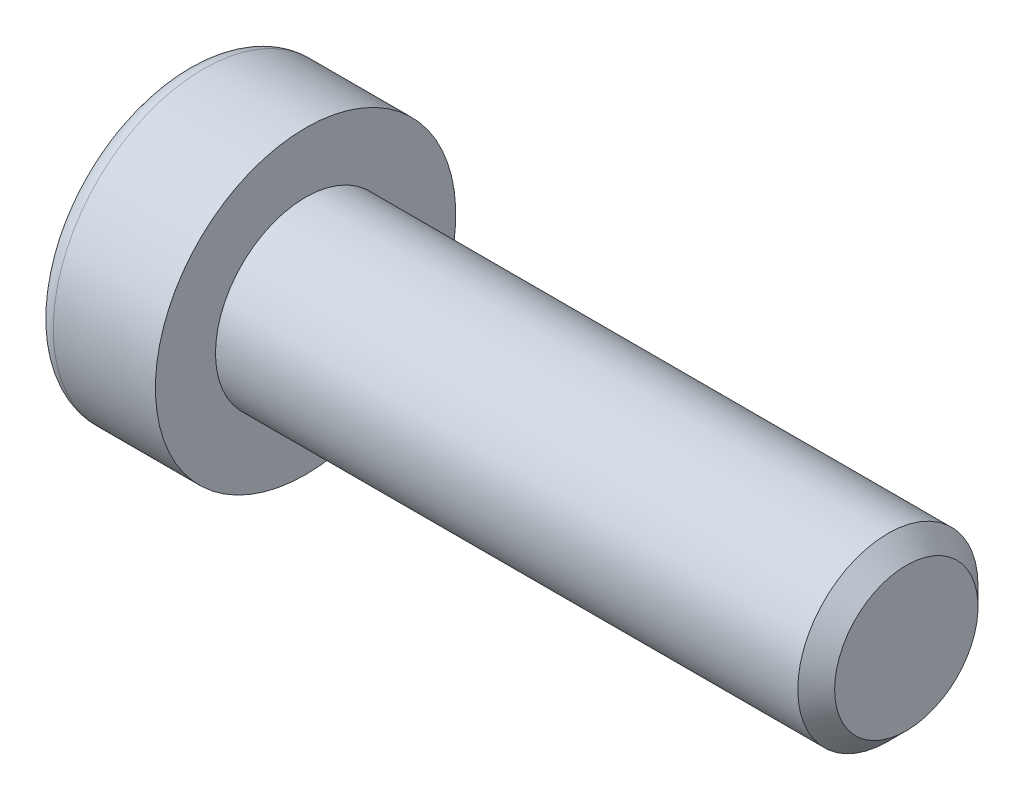
ISO-10303-21;
HEADER;
FILE_DESCRIPTION(('STEP AP214'),'2;1');
FILE_NAME('part.step','',(''),(''),'','','');
FILE_SCHEMA(('AUTOMOTIVE_DESIGN { 1 0 10303 214 1 1 1 1 }'));
ENDSEC;
DATA;
#1=APPLICATION_CONTEXT('core data for automotive mechanical design processes');
#2=APPLICATION_PROTOCOL_DEFINITION('international standard','automotive_design',2000,#1);
#3=PRODUCT_CONTEXT('',#1,'mechanical');
#4=PRODUCT('Part','Part','',(#3));
#5=PRODUCT_RELATED_PRODUCT_CATEGORY('part','',(#4));
#6=PRODUCT_DEFINITION_FORMATION('','',#4);
#7=PRODUCT_DEFINITION_CONTEXT('part definition',#1,'design');
#8=PRODUCT_DEFINITION('design','',#6,#7);
#9=PRODUCT_DEFINITION_SHAPE('','',#8);
#10=(LENGTH_UNIT() NAMED_UNIT(*) SI_UNIT(.MILLI.,.METRE.));
#11=(NAMED_UNIT(*) PLANE_ANGLE_UNIT() SI_UNIT($,.RADIAN.));
#12=(NAMED_UNIT(*) SI_UNIT($,.STERADIAN.) SOLID_ANGLE_UNIT());
#13=UNCERTAINTY_MEASURE_WITH_UNIT(LENGTH_MEASURE(1.E-05),#10,'distance_accuracy_value','');
#14=(GEOMETRIC_REPRESENTATION_CONTEXT(3) GLOBAL_UNCERTAINTY_ASSIGNED_CONTEXT((#13)) GLOBAL_UNIT_ASSIGNED_CONTEXT((#10,
#11,#12)) REPRESENTATION_CONTEXT('',''));
#15=CARTESIAN_POINT('',(0.,0.,0.));
#16=DIRECTION('',(0.,0.,1.));
#17=DIRECTION('',(1.,0.,0.));
#18=AXIS2_PLACEMENT_3D('',#15,#16,#17);
#19=CARTESIAN_POINT('',(-1.00800000126355,0.,0.));
#20=DIRECTION('',(-1.,0.,0.));
#21=DIRECTION('',(0.,0.,1.));
#22=AXIS2_PLACEMENT_3D('',#19,#20,#21);
#23=CONICAL_SURFACE('',#22,2.32325748220319,1.04719754984266);
#24=CARTESIAN_POINT('',(0.333333335333919,-2.27373675443232E-10,0.));
#25=VERTEX_POINT('',#24);
#26=VERTEX_LOOP('',#25);
#27=FACE_BOUND('',#26,.T.);
#28=CARTESIAN_POINT('',(-1.00000000148083,2.00000000033728,1.15470053795177));
#29=CARTESIAN_POINT('',(-0.970695546656412,2.00000000012114,1.05321634683082));
#30=CARTESIAN_POINT('',(-0.944044678609069,2.00000000003247,0.950856145630905));
#31=CARTESIAN_POINT('',(-0.897526388820767,1.99999999996746,0.744363444823034));
#32=CARTESIAN_POINT('',(-0.877675421691299,1.99999999999139,0.640227277433704));
#33=CARTESIAN_POINT('',(-0.84677596021723,2.0000000000084,0.433245449975039));
#34=CARTESIAN_POINT('',(-0.835521788851128,2.00000000000224,0.330431627792259));
#35=CARTESIAN_POINT('',(-0.822089169378264,1.99999999999776,0.124320462818436));
#36=CARTESIAN_POINT('',(-0.819899595232345,1.99999999999944,0.021023868671409));
#37=CARTESIAN_POINT('',(-0.824466291460138,2.00000000000049,-0.17197473600168));
#38=CARTESIAN_POINT('',(-0.830101286547052,2.00000000000013,-0.261705707541263));
#39=CARTESIAN_POINT('',(-0.847957302106096,1.99999999999987,-0.440583082607356));
#40=CARTESIAN_POINT('',(-0.86018441618838,1.99999999999996,-0.529728867906561));
#41=CARTESIAN_POINT('',(-0.890749834828529,2.00000000000004,-0.708974747233866));
#42=CARTESIAN_POINT('',(-0.909217643747823,2.00000000000002,-0.799052166721046));
#43=CARTESIAN_POINT('',(-0.95113176245156,1.99999999999998,-0.977863889550313));
#44=CARTESIAN_POINT('',(-0.974568230407688,1.99999999999996,-1.06660048191016));
#45=CARTESIAN_POINT('',(-1.00000000170015,2.,-1.15470053794658));
#46=B_SPLINE_CURVE_WITH_KNOTS('',3,(#28,#29,#30,#31,#32,#33,#34,#35,#36,#37,#38,#39,#40,#41,#42,
#43,#44,#45),.UNSPECIFIED.,.F.,.F.,(4,2,2,2,2,2,2,2,4),(0.,0.317016011629405,0.634793817184081,
0.944707606355673,1.25424088914081,1.52370778262096,1.79342419353215,2.06912162199251,
2.34427797278028),.UNSPECIFIED.);
#47=CARTESIAN_POINT('',(-1.00000000168466,1.99999999978942,1.15470053825767));
#48=VERTEX_POINT('',#47);
#49=CARTESIAN_POINT('',(-1.00000000175485,2.,-1.15470053813609));
#50=VERTEX_POINT('',#49);
#51=EDGE_CURVE('E19',#48,#50,#46,.T.);
#52=ORIENTED_EDGE('',*,*,#51,.T.);
#53=CARTESIAN_POINT('',(-1.00000000148083,1.99999999979843,-1.15470053888509));
#54=CARTESIAN_POINT('',(-0.970695546656412,1.91211211209711,-1.20544263425837));
#55=CARTESIAN_POINT('',(-0.944044678609069,1.82346557747715,-1.25662273478154));
#56=CARTESIAN_POINT('',(-0.897526388820767,1.64463765284897,-1.35986908512917));
#57=CARTESIAN_POINT('',(-0.877675421691298,1.55445308644903,-1.41193716884456));
#58=CARTESIAN_POINT('',(-0.846775960217229,1.37520156575661,-1.51542808258863));
#59=CARTESIAN_POINT('',(-0.835521788851128,1.28616218388306,-1.56683499367469));
#60=CARTESIAN_POINT('',(-0.822089169378263,1.10766467900989,-1.66989057615772));
#61=CARTESIAN_POINT('',(-0.819899595232344,1.01820720435499,-1.72153887323269));
#62=CARTESIAN_POINT('',(-0.824466291460137,0.851065509813669,-1.81803817557014));
#63=CARTESIAN_POINT('',(-0.830101286547051,0.773356208953953,-1.86290366133962));
#64=CARTESIAN_POINT('',(-0.847957302106095,0.618443857984307,-1.95234234887244));
#65=CARTESIAN_POINT('',(-0.860184416188378,0.541241343274929,-1.99691524152212));
#66=CARTESIAN_POINT('',(-0.890749834828528,0.38600985825384,-2.08653818118584));
#67=CARTESIAN_POINT('',(-0.909217643747822,0.308000524670585,-2.13157689092942));
#68=CARTESIAN_POINT('',(-0.951131762451559,0.153145030205958,-2.22098275234402));
#69=CARTESIAN_POINT('',(-0.974568230407687,0.0762968869770577,-2.26535104852392));
#70=CARTESIAN_POINT('',(-1.00000000170015,3.74707656133812E-10,-2.30940107654216));
#71=B_SPLINE_CURVE_WITH_KNOTS('',3,(#53,#54,#55,#56,#57,#58,#59,#60,#61,#62,#63,#64,#65,#66,#67,
#68,#69,#70),.UNSPECIFIED.,.F.,.F.,(4,2,2,2,2,2,2,2,4),(0.,0.317016011629405,0.63479381718408,
0.944707606355672,1.25424088914081,1.52370778262096,1.79342419353215,2.06912162199251,
2.34427797278029),.UNSPECIFIED.);
#72=CARTESIAN_POINT('',(-1.00000000168466,0.,-2.30940107651534));
#73=VERTEX_POINT('',#72);
#74=EDGE_CURVE('E79',#50,#73,#71,.T.);
#75=ORIENTED_EDGE('',*,*,#74,.T.);
#76=CARTESIAN_POINT('',(-1.00000000148083,-5.38851015969026E-10,-2.30940107683686));
#77=CARTESIAN_POINT('',(-0.970695546656412,-0.0878878880240315,-2.2586589810892));
#78=CARTESIAN_POINT('',(-0.944044678609069,-0.176534422555313,-2.20747888041245));
#79=CARTESIAN_POINT('',(-0.897526388820767,-0.355362347118483,-2.10423252995221));
#80=CARTESIAN_POINT('',(-0.877675421691298,-0.445546913542356,-2.05216444627827));
#81=CARTESIAN_POINT('',(-0.846775960217229,-0.624798434251795,-1.94867353256367));
#82=CARTESIAN_POINT('',(-0.835521788851128,-0.713837816119178,-1.89726662146695));
#83=CARTESIAN_POINT('',(-0.822089169378263,-0.892335320987875,-1.79421103897616));
#84=CARTESIAN_POINT('',(-0.819899595232344,-0.98179279564445,-1.7425627419041));
#85=CARTESIAN_POINT('',(-0.824466291460138,-1.14893449018682,-1.64606343956846));
#86=CARTESIAN_POINT('',(-0.830101286547052,-1.22664379104618,-1.60119795379836));
#87=CARTESIAN_POINT('',(-0.847957302106096,-1.38155614201556,-1.51175926626509));
#88=CARTESIAN_POINT('',(-0.860184416188379,-1.45875865672503,-1.46718637361556));
#89=CARTESIAN_POINT('',(-0.890749834828528,-1.6139901417462,-1.37756343395198));
#90=CARTESIAN_POINT('',(-0.909217643747822,-1.69199947532943,-1.33252472420837));
#91=CARTESIAN_POINT('',(-0.951131762451559,-1.84685496979402,-1.2431188627937));
#92=CARTESIAN_POINT('',(-0.974568230407687,-1.9237031130229,-1.19875056661376));
#93=CARTESIAN_POINT('',(-1.00000000170015,-1.99999999962529,-1.15470053859559));
#94=B_SPLINE_CURVE_WITH_KNOTS('',3,(#76,#77,#78,#79,#80,#81,#82,#83,#84,#85,#86,#87,#88,#89,#90,
#91,#92,#93),.UNSPECIFIED.,.F.,.F.,(4,2,2,2,2,2,2,2,4),(0.,0.317016011629406,0.634793817184081,
0.944707606355673,1.25424088914081,1.52370778262096,1.79342419353215,2.06912162199251,
2.34427797278029),.UNSPECIFIED.);
#95=CARTESIAN_POINT('',(-1.00000000168466,-1.99999999978942,-1.15470053825767));
#96=VERTEX_POINT('',#95);
#97=EDGE_CURVE('E104',#73,#96,#94,.T.);
#98=ORIENTED_EDGE('',*,*,#97,.T.);
#99=CARTESIAN_POINT('',(-1.00000000148083,-2.00000000033728,-1.15470053795177));
#100=CARTESIAN_POINT('',(-0.970695546656412,-2.00000000012114,-1.05321634683083));
#101=CARTESIAN_POINT('',(-0.944044678609069,-2.00000000003247,-0.950856145630907));
#102=CARTESIAN_POINT('',(-0.897526388820767,-1.99999999996746,-0.744363444823035));
#103=CARTESIAN_POINT('',(-0.877675421691298,-1.99999999999138,-0.640227277433706));
#104=CARTESIAN_POINT('',(-0.846775960217229,-2.0000000000084,-0.433245449975041));
#105=CARTESIAN_POINT('',(-0.835521788851128,-2.00000000000224,-0.330431627792261));
#106=CARTESIAN_POINT('',(-0.822089169378263,-1.99999999999776,-0.124320462818438));
#107=CARTESIAN_POINT('',(-0.819899595232344,-1.99999999999944,-0.0210238686714111));
#108=CARTESIAN_POINT('',(-0.824466291460138,-2.00000000000049,0.171974736001678));
#109=CARTESIAN_POINT('',(-0.830101286547052,-2.00000000000013,0.261705707541261));
#110=CARTESIAN_POINT('',(-0.847957302106096,-1.99999999999987,0.440583082607354));
#111=CARTESIAN_POINT('',(-0.860184416188379,-1.99999999999996,0.52972886790656));
#112=CARTESIAN_POINT('',(-0.890749834828528,-2.00000000000004,0.708974747233865));
#113=CARTESIAN_POINT('',(-0.909217643747822,-2.00000000000002,0.799052166721045));
#114=CARTESIAN_POINT('',(-0.951131762451559,-1.99999999999998,0.977863889550313));
#115=CARTESIAN_POINT('',(-0.974568230407687,-1.99999999999996,1.06660048191016));
#116=CARTESIAN_POINT('',(-1.00000000170015,-2.,1.15470053794658));
#117=B_SPLINE_CURVE_WITH_KNOTS('',3,(#99,#100,#101,#102,#103,#104,#105,#106,#107,#108,#109,#110,
#111,#112,#113,#114,#115,#116),.UNSPECIFIED.,.F.,.F.,(4,2,2,2,2,2,2,2,4),(0.,0.317016011629405,
0.63479381718408,0.944707606355672,1.25424088914081,1.52370778262096,1.79342419353215,
2.06912162199251,2.34427797278029),.UNSPECIFIED.);
#118=CARTESIAN_POINT('',(-1.00000000168466,-1.99999999978942,1.15470053825767));
#119=VERTEX_POINT('',#118);
#120=EDGE_CURVE('E128',#96,#119,#117,.T.);
#121=ORIENTED_EDGE('',*,*,#120,.T.);
#122=CARTESIAN_POINT('',(-1.00000000148083,-1.99999999979843,1.15470053888509));
#123=CARTESIAN_POINT('',(-0.970695546656412,-1.91211211209711,1.20544263425837));
#124=CARTESIAN_POINT('',(-0.944044678609069,-1.82346557747715,1.25662273478154));
#125=CARTESIAN_POINT('',(-0.897526388820767,-1.64463765284897,1.35986908512917));
#126=CARTESIAN_POINT('',(-0.877675421691298,-1.55445308644903,1.41193716884456));
#127=CARTESIAN_POINT('',(-0.846775960217229,-1.37520156575661,1.51542808258863));
#128=CARTESIAN_POINT('',(-0.835521788851128,-1.28616218388306,1.56683499367469));
#129=CARTESIAN_POINT('',(-0.822089169378263,-1.10766467900989,1.66989057615772));
#130=CARTESIAN_POINT('',(-0.819899595232344,-1.01820720435499,1.72153887323269));
#131=CARTESIAN_POINT('',(-0.824466291460137,-0.85106550981367,1.81803817557014));
#132=CARTESIAN_POINT('',(-0.830101286547051,-0.773356208953954,1.86290366133962));
#133=CARTESIAN_POINT('',(-0.847957302106095,-0.618443857984308,1.95234234887244));
#134=CARTESIAN_POINT('',(-0.860184416188379,-0.54124134327493,1.99691524152212));
#135=CARTESIAN_POINT('',(-0.890749834828528,-0.386009858253842,2.08653818118584));
#136=CARTESIAN_POINT('',(-0.909217643747822,-0.308000524670587,2.13157689092942));
#137=CARTESIAN_POINT('',(-0.951131762451559,-0.15314503020596,2.22098275234402));
#138=CARTESIAN_POINT('',(-0.974568230407686,-0.0762968869770593,2.26535104852392));
#139=CARTESIAN_POINT('',(-1.00000000170015,-3.7470927173599E-10,2.30940107654216));
#140=B_SPLINE_CURVE_WITH_KNOTS('',3,(#122,#123,#124,#125,#126,#127,#128,#129,#130,#131,#132,
#133,#134,#135,#136,#137,#138,#139),.UNSPECIFIED.,.F.,.F.,(4,2,2,2,2,2,2,2,4),(0.,
0.317016011629405,0.63479381718408,0.944707606355672,1.25424088914081,1.52370778262096,
1.79342419353215,2.06912162199251,2.34427797278028),.UNSPECIFIED.);
#141=CARTESIAN_POINT('',(-1.00000000168466,0.,2.30940107651534));
#142=VERTEX_POINT('',#141);
#143=EDGE_CURVE('E136',#119,#142,#140,.T.);
#144=ORIENTED_EDGE('',*,*,#143,.T.);
#145=CARTESIAN_POINT('',(-1.00000000148083,5.38850869545381E-10,2.30940107683686));
#146=CARTESIAN_POINT('',(-0.970695546656412,0.0878878880240314,2.2586589810892));
#147=CARTESIAN_POINT('',(-0.944044678609069,0.176534422555313,2.20747888041245));
#148=CARTESIAN_POINT('',(-0.897526388820767,0.355362347118483,2.10423252995221));
#149=CARTESIAN_POINT('',(-0.877675421691298,0.445546913542355,2.05216444627827));
#150=CARTESIAN_POINT('',(-0.846775960217229,0.624798434251795,1.94867353256367));
#151=CARTESIAN_POINT('',(-0.835521788851128,0.713837816119178,1.89726662146695));
#152=CARTESIAN_POINT('',(-0.822089169378263,0.892335320987875,1.79421103897616));
#153=CARTESIAN_POINT('',(-0.819899595232344,0.981792795644449,1.7425627419041));
#154=CARTESIAN_POINT('',(-0.824466291460137,1.14893449018682,1.64606343956846));
#155=CARTESIAN_POINT('',(-0.830101286547051,1.22664379104618,1.60119795379836));
#156=CARTESIAN_POINT('',(-0.847957302106095,1.38155614201556,1.51175926626508));
#157=CARTESIAN_POINT('',(-0.860184416188378,1.45875865672503,1.46718637361556));
#158=CARTESIAN_POINT('',(-0.890749834828528,1.6139901417462,1.37756343395198));
#159=CARTESIAN_POINT('',(-0.909217643747822,1.69199947532943,1.33252472420837));
#160=CARTESIAN_POINT('',(-0.951131762451559,1.84685496979402,1.2431188627937));
#161=CARTESIAN_POINT('',(-0.974568230407686,1.9237031130229,1.19875056661376));
#162=CARTESIAN_POINT('',(-1.00000000170015,1.99999999962529,1.15470053859559));
#163=B_SPLINE_CURVE_WITH_KNOTS('',3,(#145,#146,#147,#148,#149,#150,#151,#152,#153,#154,#155,
#156,#157,#158,#159,#160,#161,#162),.UNSPECIFIED.,.F.,.F.,(4,2,2,2,2,2,2,2,4),(0.,
0.317016011629406,0.63479381718408,0.944707606355672,1.25424088914081,1.52370778262096,
1.79342419353215,2.06912162199251,2.34427797278029),.UNSPECIFIED.);
#164=EDGE_CURVE('E81',#142,#48,#163,.T.);
#165=ORIENTED_EDGE('',*,*,#164,.T.);
#166=EDGE_LOOP('',(#52,#75,#98,#121,#144,#165));
#167=FACE_BOUND('',#166,.T.);
#168=ADVANCED_FACE('F15',(#27,#167),#23,.F.);
#169=CARTESIAN_POINT('',(-3.99999999999999,2.,1.15470053837925));
#170=DIRECTION('',(0.,1.,0.));
#171=DIRECTION('',(0.,0.,1.));
#172=AXIS2_PLACEMENT_3D('',#169,#170,#171);
#173=PLANE('',#172);
#174=DIRECTION('',(1.,0.,0.));
#175=VECTOR('',#174,1.);
#176=CARTESIAN_POINT('',(-3.99999999999999,2.,1.15470053837925));
#177=LINE('',#176,#175);
#178=CARTESIAN_POINT('',(-3.99999999999999,2.,1.15470053837925));
#179=VERTEX_POINT('',#178);
#180=EDGE_CURVE('E83',#48,#179,#177,.F.);
#181=ORIENTED_EDGE('',*,*,#180,.T.);
#182=DIRECTION('',(0.,0.,1.));
#183=VECTOR('',#182,1.);
#184=CARTESIAN_POINT('',(-3.99999999999999,2.,0.));
#185=LINE('',#184,#183);
#186=CARTESIAN_POINT('',(-3.99999999999999,2.,-1.15470053837925));
#187=VERTEX_POINT('',#186);
#188=EDGE_CURVE('E88',#187,#179,#185,.T.);
#189=ORIENTED_EDGE('',*,*,#188,.F.);
#190=DIRECTION('',(1.,0.,0.));
#191=VECTOR('',#190,1.);
#192=CARTESIAN_POINT('',(-3.99999999999999,2.,-1.15470053837925));
#193=LINE('',#192,#191);
#194=EDGE_CURVE('E86',#187,#50,#193,.T.);
#195=ORIENTED_EDGE('',*,*,#194,.T.);
#196=ORIENTED_EDGE('',*,*,#51,.F.);
#197=EDGE_LOOP('',(#181,#189,#195,#196));
#198=FACE_BOUND('',#197,.T.);
#199=ADVANCED_FACE('F75',(#198),#173,.F.);
#200=CARTESIAN_POINT('',(-3.99999999999999,0.,2.3094010767585));
#201=DIRECTION('',(0.,0.500000000000001,0.866025403784438));
#202=DIRECTION('',(0.,-0.866025403784438,0.500000000000001));
#203=AXIS2_PLACEMENT_3D('',#200,#201,#202);
#204=PLANE('',#203);
#205=DIRECTION('',(1.,0.,0.));
#206=VECTOR('',#205,1.);
#207=CARTESIAN_POINT('',(-3.99999999999999,0.,2.3094010767585));
#208=LINE('',#207,#206);
#209=CARTESIAN_POINT('',(-3.99999999999999,0.,2.3094010767585));
#210=VERTEX_POINT('',#209);
#211=EDGE_CURVE('E140',#142,#210,#208,.F.);
#212=ORIENTED_EDGE('',*,*,#211,.T.);
#213=DIRECTION('',(0.,-0.866025403784438,0.500000000000001));
#214=VECTOR('',#213,1.);
#215=CARTESIAN_POINT('',(-3.99999999999999,2.,1.15470053837925));
#216=LINE('',#215,#214);
#217=EDGE_CURVE('E94',#179,#210,#216,.T.);
#218=ORIENTED_EDGE('',*,*,#217,.F.);
#219=ORIENTED_EDGE('',*,*,#180,.F.);
#220=ORIENTED_EDGE('',*,*,#164,.F.);
#221=EDGE_LOOP('',(#212,#218,#219,#220));
#222=FACE_BOUND('',#221,.T.);
#223=ADVANCED_FACE('F144',(#222),#204,.F.);
#224=CARTESIAN_POINT('',(-3.99999999999999,-2.,1.15470053837925));
#225=DIRECTION('',(0.,-0.5,0.866025403784439));
#226=DIRECTION('',(0.,-0.866025403784439,-0.5));
#227=AXIS2_PLACEMENT_3D('',#224,#225,#226);
#228=PLANE('',#227);
#229=DIRECTION('',(1.,0.,0.));
#230=VECTOR('',#229,1.);
#231=CARTESIAN_POINT('',(-3.99999999999999,-2.,1.15470053837925));
#232=LINE('',#231,#230);
#233=CARTESIAN_POINT('',(-3.99999999999999,-2.,1.15470053837925));
#234=VERTEX_POINT('',#233);
#235=EDGE_CURVE('E135',#119,#234,#232,.F.);
#236=ORIENTED_EDGE('',*,*,#235,.T.);
#237=DIRECTION('',(0.,-0.866025403784439,-0.5));
#238=VECTOR('',#237,1.);
#239=CARTESIAN_POINT('',(-3.99999999999999,0.,2.3094010767585));
#240=LINE('',#239,#238);
#241=EDGE_CURVE('E223',#210,#234,#240,.T.);
#242=ORIENTED_EDGE('',*,*,#241,.F.);
#243=ORIENTED_EDGE('',*,*,#211,.F.);
#244=ORIENTED_EDGE('',*,*,#143,.F.);
#245=EDGE_LOOP('',(#236,#242,#243,#244));
#246=FACE_BOUND('',#245,.T.);
#247=ADVANCED_FACE('F124',(#246),#228,.F.);
#248=CARTESIAN_POINT('',(-3.99999999999999,-2.,-1.15470053837925));
#249=DIRECTION('',(0.,-1.,0.));
#250=DIRECTION('',(0.,0.,-1.));
#251=AXIS2_PLACEMENT_3D('',#248,#249,#250);
#252=PLANE('',#251);
#253=DIRECTION('',(1.,0.,0.));
#254=VECTOR('',#253,1.);
#255=CARTESIAN_POINT('',(-3.99999999999999,-2.,-1.15470053837925));
#256=LINE('',#255,#254);
#257=CARTESIAN_POINT('',(-3.99999999999999,-2.,-1.15470053837925));
#258=VERTEX_POINT('',#257);
#259=EDGE_CURVE('E134',#96,#258,#256,.F.);
#260=ORIENTED_EDGE('',*,*,#259,.T.);
#261=DIRECTION('',(0.,0.,1.));
#262=VECTOR('',#261,1.);
#263=CARTESIAN_POINT('',(-3.99999999999999,-2.,0.));
#264=LINE('',#263,#262);
#265=EDGE_CURVE('E220',#234,#258,#264,.F.);
#266=ORIENTED_EDGE('',*,*,#265,.F.);
#267=ORIENTED_EDGE('',*,*,#235,.F.);
#268=ORIENTED_EDGE('',*,*,#120,.F.);
#269=EDGE_LOOP('',(#260,#266,#267,#268));
#270=FACE_BOUND('',#269,.T.);
#271=ADVANCED_FACE('F120',(#270),#252,.F.);
#272=CARTESIAN_POINT('',(-3.99999999999999,0.,-2.3094010767585));
#273=DIRECTION('',(0.,-0.5,-0.866025403784438));
#274=DIRECTION('',(0.,0.866025403784438,-0.5));
#275=AXIS2_PLACEMENT_3D('',#272,#273,#274);
#276=PLANE('',#275);
#277=DIRECTION('',(1.,0.,0.));
#278=VECTOR('',#277,1.);
#279=CARTESIAN_POINT('',(-3.99999999999999,0.,-2.3094010767585));
#280=LINE('',#279,#278);
#281=CARTESIAN_POINT('',(-3.99999999999999,0.,-2.3094010767585));
#282=VERTEX_POINT('',#281);
#283=EDGE_CURVE('E37',#73,#282,#280,.F.);
#284=ORIENTED_EDGE('',*,*,#283,.T.);
#285=DIRECTION('',(0.,0.866025403784438,-0.5));
#286=VECTOR('',#285,1.);
#287=CARTESIAN_POINT('',(-3.99999999999999,-2.,-1.15470053837925));
#288=LINE('',#287,#286);
#289=EDGE_CURVE('E217',#258,#282,#288,.T.);
#290=ORIENTED_EDGE('',*,*,#289,.F.);
#291=ORIENTED_EDGE('',*,*,#259,.F.);
#292=ORIENTED_EDGE('',*,*,#97,.F.);
#293=EDGE_LOOP('',(#284,#290,#291,#292));
#294=FACE_BOUND('',#293,.T.);
#295=ADVANCED_FACE('F114',(#294),#276,.F.);
#296=CARTESIAN_POINT('',(-3.99999999999999,2.,-1.15470053837925));
#297=DIRECTION('',(0.,0.5,-0.866025403784439));
#298=DIRECTION('',(0.,0.866025403784439,0.5));
#299=AXIS2_PLACEMENT_3D('',#296,#297,#298);
#300=PLANE('',#299);
#301=ORIENTED_EDGE('',*,*,#194,.F.);
#302=DIRECTION('',(0.,0.866025403784439,0.5));
#303=VECTOR('',#302,1.);
#304=CARTESIAN_POINT('',(-3.99999999999999,0.,-2.3094010767585));
#305=LINE('',#304,#303);
#306=EDGE_CURVE('E215',#282,#187,#305,.T.);
#307=ORIENTED_EDGE('',*,*,#306,.F.);
#308=ORIENTED_EDGE('',*,*,#283,.F.);
#309=ORIENTED_EDGE('',*,*,#74,.F.);
#310=EDGE_LOOP('',(#301,#307,#308,#309));
#311=FACE_BOUND('',#310,.T.);
#312=ADVANCED_FACE('F92',(#311),#300,.F.);
#313=CARTESIAN_POINT('',(-3.99999999999999,3.65470053837925,0.));
#314=DIRECTION('',(-1.,0.,0.));
#315=DIRECTION('',(0.,0.,1.));
#316=AXIS2_PLACEMENT_3D('',#313,#314,#315);
#317=PLANE('',#316);
#318=ORIENTED_EDGE('',*,*,#289,.T.);
#319=ORIENTED_EDGE('',*,*,#306,.T.);
#320=ORIENTED_EDGE('',*,*,#188,.T.);
#321=ORIENTED_EDGE('',*,*,#217,.T.);
#322=ORIENTED_EDGE('',*,*,#241,.T.);
#323=ORIENTED_EDGE('',*,*,#265,.T.);
#324=EDGE_LOOP('',(#318,#319,#320,#321,#322,#323));
#325=FACE_BOUND('',#324,.T.);
#326=CARTESIAN_POINT('',(-3.99999999999999,0.,0.));
#327=DIRECTION('',(1.,0.,0.));
#328=DIRECTION('',(0.,1.,0.));
#329=AXIS2_PLACEMENT_3D('',#326,#327,#328);
#330=CIRCLE('',#329,4.4);
#331=CARTESIAN_POINT('',(-3.99999999999999,4.4,0.));
#332=VERTEX_POINT('',#331);
#333=EDGE_CURVE('E192',#332,#332,#330,.T.);
#334=ORIENTED_EDGE('',*,*,#333,.F.);
#335=EDGE_LOOP('',(#334));
#336=FACE_BOUND('',#335,.T.);
#337=ADVANCED_FACE('F113',(#325,#336),#317,.T.);
#338=CARTESIAN_POINT('',(-3.4,0.,0.));
#339=DIRECTION('',(1.,0.,0.));
#340=DIRECTION('',(0.,0.,-1.));
#341=AXIS2_PLACEMENT_3D('',#338,#339,#340);
#342=TOROIDAL_SURFACE('',#341,4.4,0.6);
#343=CARTESIAN_POINT('',(-3.4,0.,0.));
#344=DIRECTION('',(1.,0.,0.));
#345=DIRECTION('',(0.,1.,0.));
#346=AXIS2_PLACEMENT_3D('',#343,#344,#345);
#347=CIRCLE('',#346,5.);
#348=CARTESIAN_POINT('',(-3.4,5.,0.));
#349=VERTEX_POINT('',#348);
#350=EDGE_CURVE('E233',#349,#349,#347,.T.);
#351=ORIENTED_EDGE('',*,*,#350,.F.);
#352=EDGE_LOOP('',(#351));
#353=FACE_BOUND('',#352,.T.);
#354=ORIENTED_EDGE('',*,*,#333,.T.);
#355=EDGE_LOOP('',(#354));
#356=FACE_BOUND('',#355,.T.);
#357=ADVANCED_FACE('F176',(#353,#356),#342,.T.);
#358=CARTESIAN_POINT('',(-2.,0.,0.));
#359=DIRECTION('',(1.,0.,0.));
#360=DIRECTION('',(0.,1.,0.));
#361=AXIS2_PLACEMENT_3D('',#358,#359,#360);
#362=CYLINDRICAL_SURFACE('',#361,5.);
#363=ORIENTED_EDGE('',*,*,#350,.T.);
#364=EDGE_LOOP('',(#363));
#365=FACE_BOUND('',#364,.T.);
#366=CARTESIAN_POINT('',(0.,0.,0.));
#367=DIRECTION('',(1.,0.,0.));
#368=DIRECTION('',(0.,1.,0.));
#369=AXIS2_PLACEMENT_3D('',#366,#367,#368);
#370=CIRCLE('',#369,5.);
#371=CARTESIAN_POINT('',(0.,5.,0.));
#372=VERTEX_POINT('',#371);
#373=EDGE_CURVE('E102',#372,#372,#370,.T.);
#374=ORIENTED_EDGE('',*,*,#373,.F.);
#375=EDGE_LOOP('',(#374));
#376=FACE_BOUND('',#375,.T.);
#377=ADVANCED_FACE('F173',(#365,#376),#362,.T.);
#378=CARTESIAN_POINT('',(20.,1.5,0.));
#379=DIRECTION('',(1.,0.,0.));
#380=DIRECTION('',(0.,0.,-1.));
#381=AXIS2_PLACEMENT_3D('',#378,#379,#380);
#382=PLANE('',#381);
#383=CARTESIAN_POINT('',(20.000000000266,0.,0.));
#384=DIRECTION('',(-1.,0.,0.));
#385=DIRECTION('',(0.,0.,1.));
#386=AXIS2_PLACEMENT_3D('',#383,#384,#385);
#387=CIRCLE('',#386,2.38655000026711);
#388=CARTESIAN_POINT('',(20.000000000266,0.,2.38655000026711));
#389=VERTEX_POINT('',#388);
#390=EDGE_CURVE('E229',#389,#389,#387,.T.);
#391=ORIENTED_EDGE('',*,*,#390,.F.);
#392=EDGE_LOOP('',(#391));
#393=FACE_BOUND('',#392,.T.);
#394=ADVANCED_FACE('F169',(#393),#382,.T.);
#395=CARTESIAN_POINT('',(0.,4.,0.));
#396=DIRECTION('',(1.,0.,0.));
#397=DIRECTION('',(0.,0.,-1.));
#398=AXIS2_PLACEMENT_3D('',#395,#396,#397);
#399=PLANE('',#398);
#400=CARTESIAN_POINT('',(0.,0.,0.));
#401=DIRECTION('',(1.,0.,0.));
#402=DIRECTION('',(0.,1.,0.));
#403=AXIS2_PLACEMENT_3D('',#400,#401,#402);
#404=CIRCLE('',#403,3.);
#405=CARTESIAN_POINT('',(0.,3.,0.));
#406=VERTEX_POINT('',#405);
#407=EDGE_CURVE('E28',#406,#406,#404,.T.);
#408=ORIENTED_EDGE('',*,*,#407,.F.);
#409=EDGE_LOOP('',(#408));
#410=FACE_BOUND('',#409,.T.);
#411=ORIENTED_EDGE('',*,*,#373,.T.);
#412=EDGE_LOOP('',(#411));
#413=FACE_BOUND('',#412,.T.);
#414=ADVANCED_FACE('F162',(#410,#413),#399,.T.);
#415=CARTESIAN_POINT('',(19.3865499996946,0.,0.));
#416=DIRECTION('',(-1.,0.,0.));
#417=DIRECTION('',(0.,0.,1.));
#418=AXIS2_PLACEMENT_3D('',#415,#416,#417);
#419=CONICAL_SURFACE('',#418,2.99999999975853,0.785398162517161);
#420=ORIENTED_EDGE('',*,*,#390,.T.);
#421=EDGE_LOOP('',(#420));
#422=FACE_BOUND('',#421,.T.);
#423=CARTESIAN_POINT('',(19.38655,0.,0.));
#424=DIRECTION('',(1.,0.,0.));
#425=DIRECTION('',(0.,1.,0.));
#426=AXIS2_PLACEMENT_3D('',#423,#424,#425);
#427=CIRCLE('',#426,3.);
#428=CARTESIAN_POINT('',(19.38655,3.,0.));
#429=VERTEX_POINT('',#428);
#430=EDGE_CURVE('E10',#429,#429,#427,.F.);
#431=ORIENTED_EDGE('',*,*,#430,.F.);
#432=EDGE_LOOP('',(#431));
#433=FACE_BOUND('',#432,.T.);
#434=ADVANCED_FACE('F155',(#422,#433),#419,.T.);
#435=CARTESIAN_POINT('',(11.5,0.,0.));
#436=DIRECTION('',(1.,0.,0.));
#437=DIRECTION('',(0.,1.,0.));
#438=AXIS2_PLACEMENT_3D('',#435,#436,#437);
#439=CYLINDRICAL_SURFACE('',#438,3.);
#440=ORIENTED_EDGE('',*,*,#430,.T.);
#441=EDGE_LOOP('',(#440));
#442=FACE_BOUND('',#441,.T.);
#443=ORIENTED_EDGE('',*,*,#407,.T.);
#444=EDGE_LOOP('',(#443));
#445=FACE_BOUND('',#444,.T.);
#446=ADVANCED_FACE('F153',(#442,#445),#439,.T.);
#447=CLOSED_SHELL('',(#168,#199,#223,#247,#271,#295,#312,#337,#357,#377,#394,#414,#434,#446));
#448=MANIFOLD_SOLID_BREP('B1',#447);
#449=ADVANCED_BREP_SHAPE_REPRESENTATION('',(#18,#448),#14);
#450=SHAPE_DEFINITION_REPRESENTATION(#9,#449);
ENDSEC;
END-ISO-10303-21;
